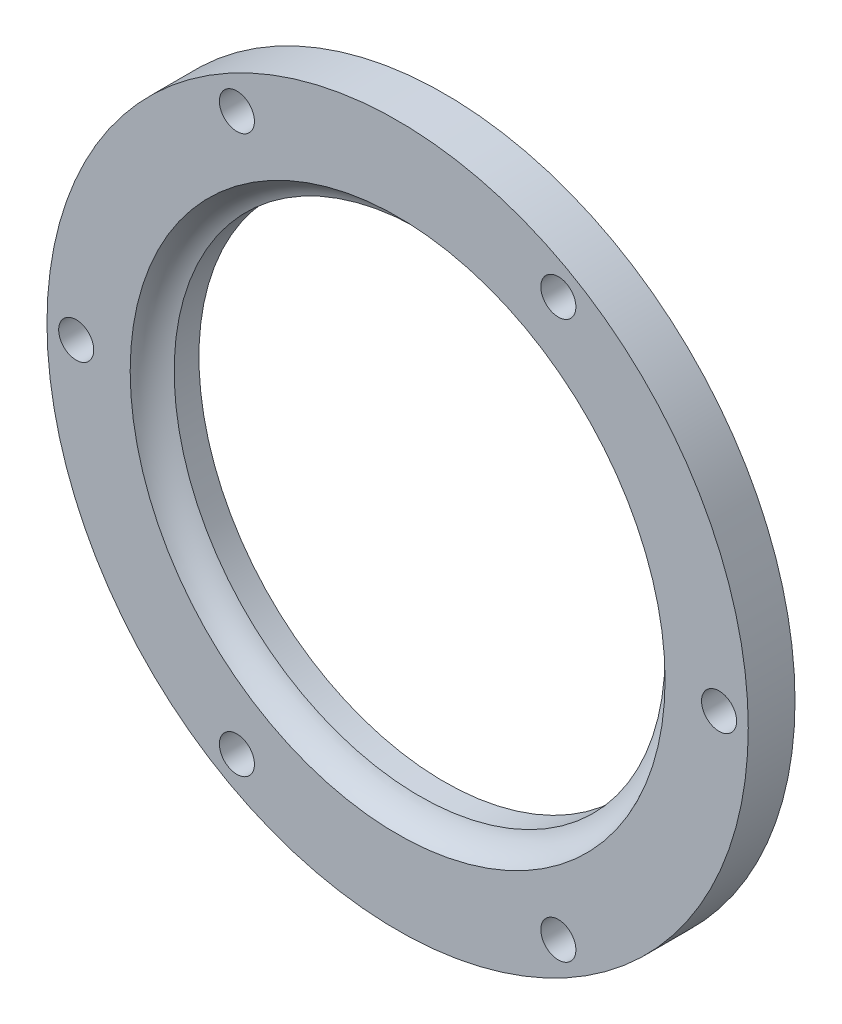
ISO-10303-21;
HEADER;
FILE_DESCRIPTION(('STEP AP214'),'2;1');
FILE_NAME('part.step','',(''),(''),'','','');
FILE_SCHEMA(('AUTOMOTIVE_DESIGN { 1 0 10303 214 1 1 1 1 }'));
ENDSEC;
DATA;
#1=APPLICATION_CONTEXT('core data for automotive mechanical design processes');
#2=APPLICATION_PROTOCOL_DEFINITION('international standard','automotive_design',2000,#1);
#3=PRODUCT_CONTEXT('',#1,'mechanical');
#4=PRODUCT('Part','Part','',(#3));
#5=PRODUCT_RELATED_PRODUCT_CATEGORY('part','',(#4));
#6=PRODUCT_DEFINITION_FORMATION('','',#4);
#7=PRODUCT_DEFINITION_CONTEXT('part definition',#1,'design');
#8=PRODUCT_DEFINITION('design','',#6,#7);
#9=PRODUCT_DEFINITION_SHAPE('','',#8);
#10=(LENGTH_UNIT() NAMED_UNIT(*) SI_UNIT(.MILLI.,.METRE.));
#11=(NAMED_UNIT(*) PLANE_ANGLE_UNIT() SI_UNIT($,.RADIAN.));
#12=(NAMED_UNIT(*) SI_UNIT($,.STERADIAN.) SOLID_ANGLE_UNIT());
#13=UNCERTAINTY_MEASURE_WITH_UNIT(LENGTH_MEASURE(1.E-05),#10,'distance_accuracy_value','');
#14=(GEOMETRIC_REPRESENTATION_CONTEXT(3) GLOBAL_UNCERTAINTY_ASSIGNED_CONTEXT((#13)) GLOBAL_UNIT_ASSIGNED_CONTEXT((#10,
#11,#12)) REPRESENTATION_CONTEXT('',''));
#15=CARTESIAN_POINT('',(0.,0.,0.));
#16=DIRECTION('',(0.,0.,1.));
#17=DIRECTION('',(1.,0.,0.));
#18=AXIS2_PLACEMENT_3D('',#15,#16,#17);
#19=CARTESIAN_POINT('',(0.,0.,4.));
#20=DIRECTION('',(0.,0.,-1.));
#21=DIRECTION('',(-1.,0.,0.));
#22=AXIS2_PLACEMENT_3D('',#19,#20,#21);
#23=CYLINDRICAL_SURFACE('',#22,21.);
#24=CARTESIAN_POINT('',(0.,0.,0.));
#25=DIRECTION('',(0.,0.,1.));
#26=DIRECTION('',(1.,0.,0.));
#27=AXIS2_PLACEMENT_3D('',#24,#25,#26);
#28=CIRCLE('',#27,21.);
#29=CARTESIAN_POINT('',(21.,0.,0.));
#30=VERTEX_POINT('',#29);
#31=EDGE_CURVE('E44',#30,#30,#28,.T.);
#32=ORIENTED_EDGE('',*,*,#31,.F.);
#33=EDGE_LOOP('',(#32));
#34=FACE_BOUND('',#33,.T.);
#35=CARTESIAN_POINT('',(0.,0.,2.11859409315522));
#36=DIRECTION('',(0.,0.,1.));
#37=DIRECTION('',(1.,0.,0.));
#38=AXIS2_PLACEMENT_3D('',#35,#36,#37);
#39=CIRCLE('',#38,21.);
#40=CARTESIAN_POINT('',(21.,0.,2.11859409315522));
#41=VERTEX_POINT('',#40);
#42=EDGE_CURVE('E35',#41,#41,#39,.T.);
#43=ORIENTED_EDGE('',*,*,#42,.T.);
#44=EDGE_LOOP('',(#43));
#45=FACE_BOUND('',#44,.T.);
#46=ADVANCED_FACE('F31',(#34,#45),#23,.F.);
#47=CARTESIAN_POINT('',(0.,0.,4.));
#48=DIRECTION('',(0.,0.,1.));
#49=DIRECTION('',(1.,0.,0.));
#50=AXIS2_PLACEMENT_3D('',#47,#48,#49);
#51=PLANE('',#50);
#52=CARTESIAN_POINT('',(-13.7500000000003,-23.8156986040719,4.));
#53=DIRECTION('',(0.,0.,1.));
#54=DIRECTION('',(1.,0.,0.));
#55=AXIS2_PLACEMENT_3D('',#52,#53,#54);
#56=CIRCLE('',#55,1.5);
#57=CARTESIAN_POINT('',(-12.2500000000003,-23.8156986040719,4.));
#58=VERTEX_POINT('',#57);
#59=EDGE_CURVE('E57',#58,#58,#56,.F.);
#60=ORIENTED_EDGE('',*,*,#59,.T.);
#61=EDGE_LOOP('',(#60));
#62=FACE_BOUND('',#61,.T.);
#63=CARTESIAN_POINT('',(13.7499999999998,-23.8156986040722,4.));
#64=DIRECTION('',(0.,0.,1.));
#65=DIRECTION('',(1.,0.,0.));
#66=AXIS2_PLACEMENT_3D('',#63,#64,#65);
#67=CIRCLE('',#66,1.5);
#68=CARTESIAN_POINT('',(15.2499999999998,-23.8156986040722,4.));
#69=VERTEX_POINT('',#68);
#70=EDGE_CURVE('E60',#69,#69,#67,.F.);
#71=ORIENTED_EDGE('',*,*,#70,.T.);
#72=EDGE_LOOP('',(#71));
#73=FACE_BOUND('',#72,.T.);
#74=CARTESIAN_POINT('',(27.5,0.,4.));
#75=DIRECTION('',(0.,0.,1.));
#76=DIRECTION('',(1.,0.,0.));
#77=AXIS2_PLACEMENT_3D('',#74,#75,#76);
#78=CIRCLE('',#77,1.5);
#79=CARTESIAN_POINT('',(29.,0.,4.));
#80=VERTEX_POINT('',#79);
#81=EDGE_CURVE('E63',#80,#80,#78,.F.);
#82=ORIENTED_EDGE('',*,*,#81,.T.);
#83=EDGE_LOOP('',(#82));
#84=FACE_BOUND('',#83,.T.);
#85=CARTESIAN_POINT('',(13.7500000000001,23.815698604072,4.));
#86=DIRECTION('',(0.,0.,1.));
#87=DIRECTION('',(1.,0.,0.));
#88=AXIS2_PLACEMENT_3D('',#85,#86,#87);
#89=CIRCLE('',#88,1.5);
#90=CARTESIAN_POINT('',(15.2500000000001,23.815698604072,4.));
#91=VERTEX_POINT('',#90);
#92=EDGE_CURVE('E66',#91,#91,#89,.F.);
#93=ORIENTED_EDGE('',*,*,#92,.T.);
#94=EDGE_LOOP('',(#93));
#95=FACE_BOUND('',#94,.T.);
#96=CARTESIAN_POINT('',(-13.7499999999999,23.8156986040721,4.));
#97=DIRECTION('',(0.,0.,1.));
#98=DIRECTION('',(1.,0.,0.));
#99=AXIS2_PLACEMENT_3D('',#96,#97,#98);
#100=CIRCLE('',#99,1.5);
#101=CARTESIAN_POINT('',(-12.2499999999999,23.8156986040721,4.));
#102=VERTEX_POINT('',#101);
#103=EDGE_CURVE('E69',#102,#102,#100,.F.);
#104=ORIENTED_EDGE('',*,*,#103,.T.);
#105=EDGE_LOOP('',(#104));
#106=FACE_BOUND('',#105,.T.);
#107=CARTESIAN_POINT('',(-27.5,0.,4.));
#108=DIRECTION('',(0.,0.,1.));
#109=DIRECTION('',(1.,0.,0.));
#110=AXIS2_PLACEMENT_3D('',#107,#108,#109);
#111=CIRCLE('',#110,1.5);
#112=CARTESIAN_POINT('',(-26.,0.,4.));
#113=VERTEX_POINT('',#112);
#114=EDGE_CURVE('E51',#113,#113,#111,.F.);
#115=ORIENTED_EDGE('',*,*,#114,.T.);
#116=EDGE_LOOP('',(#115));
#117=FACE_BOUND('',#116,.T.);
#118=CARTESIAN_POINT('',(0.,0.,4.));
#119=DIRECTION('',(0.,0.,1.));
#120=DIRECTION('',(1.,0.,0.));
#121=AXIS2_PLACEMENT_3D('',#118,#119,#120);
#122=CIRCLE('',#121,22.8814059068448);
#123=CARTESIAN_POINT('',(22.8814059068448,0.,4.));
#124=VERTEX_POINT('',#123);
#125=EDGE_CURVE('E48',#124,#124,#122,.F.);
#126=ORIENTED_EDGE('',*,*,#125,.T.);
#127=EDGE_LOOP('',(#126));
#128=FACE_BOUND('',#127,.T.);
#129=CARTESIAN_POINT('',(0.,0.,4.));
#130=DIRECTION('',(0.,0.,1.));
#131=DIRECTION('',(1.,0.,0.));
#132=AXIS2_PLACEMENT_3D('',#129,#130,#131);
#133=CIRCLE('',#132,30.);
#134=CARTESIAN_POINT('',(30.,0.,4.));
#135=VERTEX_POINT('',#134);
#136=EDGE_CURVE('E10',#135,#135,#133,.T.);
#137=ORIENTED_EDGE('',*,*,#136,.T.);
#138=EDGE_LOOP('',(#137));
#139=FACE_BOUND('',#138,.T.);
#140=ADVANCED_FACE('F109',(#62,#73,#84,#95,#106,#117,#128,#139),#51,.T.);
#141=CARTESIAN_POINT('',(0.,0.,0.));
#142=DIRECTION('',(0.,0.,1.));
#143=DIRECTION('',(1.,0.,0.));
#144=AXIS2_PLACEMENT_3D('',#141,#142,#143);
#145=PLANE('',#144);
#146=CARTESIAN_POINT('',(-13.7500000000003,-23.8156986040719,0.));
#147=DIRECTION('',(0.,0.,1.));
#148=DIRECTION('',(0.50000000000001,0.866025403784433,0.));
#149=AXIS2_PLACEMENT_3D('',#146,#147,#148);
#150=CIRCLE('',#149,1.5);
#151=CARTESIAN_POINT('',(-13.0000000000003,-22.5166604983953,0.));
#152=VERTEX_POINT('',#151);
#153=EDGE_CURVE('E76',#152,#152,#150,.T.);
#154=ORIENTED_EDGE('',*,*,#153,.T.);
#155=EDGE_LOOP('',(#154));
#156=FACE_BOUND('',#155,.T.);
#157=CARTESIAN_POINT('',(13.7499999999998,-23.8156986040722,0.));
#158=DIRECTION('',(0.,0.,1.));
#159=DIRECTION('',(-0.499999999999992,0.866025403784443,0.));
#160=AXIS2_PLACEMENT_3D('',#157,#158,#159);
#161=CIRCLE('',#160,1.5);
#162=CARTESIAN_POINT('',(12.9999999999998,-22.5166604983955,0.));
#163=VERTEX_POINT('',#162);
#164=EDGE_CURVE('E79',#163,#163,#161,.T.);
#165=ORIENTED_EDGE('',*,*,#164,.T.);
#166=EDGE_LOOP('',(#165));
#167=FACE_BOUND('',#166,.T.);
#168=CARTESIAN_POINT('',(27.5,0.,0.));
#169=DIRECTION('',(0.,0.,1.));
#170=DIRECTION('',(-1.,0.,0.));
#171=AXIS2_PLACEMENT_3D('',#168,#169,#170);
#172=CIRCLE('',#171,1.5);
#173=CARTESIAN_POINT('',(26.,0.,0.));
#174=VERTEX_POINT('',#173);
#175=EDGE_CURVE('E82',#174,#174,#172,.T.);
#176=ORIENTED_EDGE('',*,*,#175,.T.);
#177=EDGE_LOOP('',(#176));
#178=FACE_BOUND('',#177,.T.);
#179=CARTESIAN_POINT('',(13.7500000000001,23.815698604072,0.));
#180=DIRECTION('',(0.,0.,1.));
#181=DIRECTION('',(-0.500000000000004,-0.866025403784436,0.));
#182=AXIS2_PLACEMENT_3D('',#179,#180,#181);
#183=CIRCLE('',#182,1.5);
#184=CARTESIAN_POINT('',(13.0000000000001,22.5166604983954,0.));
#185=VERTEX_POINT('',#184);
#186=EDGE_CURVE('E75',#185,#185,#183,.T.);
#187=ORIENTED_EDGE('',*,*,#186,.T.);
#188=EDGE_LOOP('',(#187));
#189=FACE_BOUND('',#188,.T.);
#190=CARTESIAN_POINT('',(-13.7499999999999,23.8156986040721,0.));
#191=DIRECTION('',(0.,0.,1.));
#192=DIRECTION('',(0.499999999999998,-0.86602540378444,0.));
#193=AXIS2_PLACEMENT_3D('',#190,#191,#192);
#194=CIRCLE('',#193,1.5);
#195=CARTESIAN_POINT('',(-12.9999999999999,22.5166604983954,0.));
#196=VERTEX_POINT('',#195);
#197=EDGE_CURVE('E72',#196,#196,#194,.T.);
#198=ORIENTED_EDGE('',*,*,#197,.T.);
#199=EDGE_LOOP('',(#198));
#200=FACE_BOUND('',#199,.T.);
#201=CARTESIAN_POINT('',(-27.5,0.,0.));
#202=DIRECTION('',(0.,0.,1.));
#203=DIRECTION('',(1.,0.,0.));
#204=AXIS2_PLACEMENT_3D('',#201,#202,#203);
#205=CIRCLE('',#204,1.5);
#206=CARTESIAN_POINT('',(-26.,0.,0.));
#207=VERTEX_POINT('',#206);
#208=EDGE_CURVE('E54',#207,#207,#205,.T.);
#209=ORIENTED_EDGE('',*,*,#208,.T.);
#210=EDGE_LOOP('',(#209));
#211=FACE_BOUND('',#210,.T.);
#212=CARTESIAN_POINT('',(0.,0.,0.));
#213=DIRECTION('',(0.,0.,1.));
#214=DIRECTION('',(1.,0.,0.));
#215=AXIS2_PLACEMENT_3D('',#212,#213,#214);
#216=CIRCLE('',#215,30.);
#217=CARTESIAN_POINT('',(30.,0.,0.));
#218=VERTEX_POINT('',#217);
#219=EDGE_CURVE('E39',#218,#218,#216,.T.);
#220=ORIENTED_EDGE('',*,*,#219,.F.);
#221=EDGE_LOOP('',(#220));
#222=FACE_BOUND('',#221,.T.);
#223=ORIENTED_EDGE('',*,*,#31,.T.);
#224=EDGE_LOOP('',(#223));
#225=FACE_BOUND('',#224,.T.);
#226=ADVANCED_FACE('F88',(#156,#167,#178,#189,#200,#211,#222,#225),#145,.F.);
#227=CARTESIAN_POINT('',(0.,0.,4.));
#228=DIRECTION('',(0.,0.,-1.));
#229=DIRECTION('',(-1.,0.,0.));
#230=AXIS2_PLACEMENT_3D('',#227,#228,#229);
#231=CYLINDRICAL_SURFACE('',#230,30.);
#232=ORIENTED_EDGE('',*,*,#136,.F.);
#233=EDGE_LOOP('',(#232));
#234=FACE_BOUND('',#233,.T.);
#235=ORIENTED_EDGE('',*,*,#219,.T.);
#236=EDGE_LOOP('',(#235));
#237=FACE_BOUND('',#236,.T.);
#238=ADVANCED_FACE('F33',(#234,#237),#231,.T.);
#239=CARTESIAN_POINT('',(0.,0.,5.));
#240=DIRECTION('',(0.,0.,1.));
#241=DIRECTION('',(1.,0.,0.));
#242=AXIS2_PLACEMENT_3D('',#239,#240,#241);
#243=TOROIDAL_SURFACE('',#242,20.,3.05);
#244=ORIENTED_EDGE('',*,*,#125,.F.);
#245=EDGE_LOOP('',(#244));
#246=FACE_BOUND('',#245,.T.);
#247=ORIENTED_EDGE('',*,*,#42,.F.);
#248=EDGE_LOOP('',(#247));
#249=FACE_BOUND('',#248,.T.);
#250=ADVANCED_FACE('F120',(#246,#249),#243,.F.);
#251=CARTESIAN_POINT('',(-27.5,0.,10.));
#252=DIRECTION('',(0.,0.,-1.));
#253=DIRECTION('',(-1.,0.,0.));
#254=AXIS2_PLACEMENT_3D('',#251,#252,#253);
#255=CYLINDRICAL_SURFACE('',#254,1.5);
#256=ORIENTED_EDGE('',*,*,#114,.F.);
#257=EDGE_LOOP('',(#256));
#258=FACE_BOUND('',#257,.T.);
#259=ORIENTED_EDGE('',*,*,#208,.F.);
#260=EDGE_LOOP('',(#259));
#261=FACE_BOUND('',#260,.T.);
#262=ADVANCED_FACE('F104',(#258,#261),#255,.F.);
#263=CARTESIAN_POINT('',(-13.7499999999999,23.8156986040721,10.));
#264=DIRECTION('',(0.,0.,-1.));
#265=DIRECTION('',(-1.,0.,0.));
#266=AXIS2_PLACEMENT_3D('',#263,#264,#265);
#267=CYLINDRICAL_SURFACE('',#266,1.5);
#268=ORIENTED_EDGE('',*,*,#103,.F.);
#269=EDGE_LOOP('',(#268));
#270=FACE_BOUND('',#269,.T.);
#271=ORIENTED_EDGE('',*,*,#197,.F.);
#272=EDGE_LOOP('',(#271));
#273=FACE_BOUND('',#272,.T.);
#274=ADVANCED_FACE('F94',(#270,#273),#267,.F.);
#275=CARTESIAN_POINT('',(13.7500000000001,23.815698604072,10.));
#276=DIRECTION('',(0.,0.,-1.));
#277=DIRECTION('',(-1.,0.,0.));
#278=AXIS2_PLACEMENT_3D('',#275,#276,#277);
#279=CYLINDRICAL_SURFACE('',#278,1.5);
#280=ORIENTED_EDGE('',*,*,#92,.F.);
#281=EDGE_LOOP('',(#280));
#282=FACE_BOUND('',#281,.T.);
#283=ORIENTED_EDGE('',*,*,#186,.F.);
#284=EDGE_LOOP('',(#283));
#285=FACE_BOUND('',#284,.T.);
#286=ADVANCED_FACE('F91',(#282,#285),#279,.F.);
#287=CARTESIAN_POINT('',(27.5,0.,10.));
#288=DIRECTION('',(0.,0.,-1.));
#289=DIRECTION('',(-1.,0.,0.));
#290=AXIS2_PLACEMENT_3D('',#287,#288,#289);
#291=CYLINDRICAL_SURFACE('',#290,1.5);
#292=ORIENTED_EDGE('',*,*,#81,.F.);
#293=EDGE_LOOP('',(#292));
#294=FACE_BOUND('',#293,.T.);
#295=ORIENTED_EDGE('',*,*,#175,.F.);
#296=EDGE_LOOP('',(#295));
#297=FACE_BOUND('',#296,.T.);
#298=ADVANCED_FACE('F93',(#294,#297),#291,.F.);
#299=CARTESIAN_POINT('',(13.7499999999998,-23.8156986040722,10.));
#300=DIRECTION('',(0.,0.,-1.));
#301=DIRECTION('',(-1.,0.,0.));
#302=AXIS2_PLACEMENT_3D('',#299,#300,#301);
#303=CYLINDRICAL_SURFACE('',#302,1.5);
#304=ORIENTED_EDGE('',*,*,#70,.F.);
#305=EDGE_LOOP('',(#304));
#306=FACE_BOUND('',#305,.T.);
#307=ORIENTED_EDGE('',*,*,#164,.F.);
#308=EDGE_LOOP('',(#307));
#309=FACE_BOUND('',#308,.T.);
#310=ADVANCED_FACE('F101',(#306,#309),#303,.F.);
#311=CARTESIAN_POINT('',(-13.7500000000003,-23.8156986040719,10.));
#312=DIRECTION('',(0.,0.,-1.));
#313=DIRECTION('',(-1.,0.,0.));
#314=AXIS2_PLACEMENT_3D('',#311,#312,#313);
#315=CYLINDRICAL_SURFACE('',#314,1.5);
#316=ORIENTED_EDGE('',*,*,#59,.F.);
#317=EDGE_LOOP('',(#316));
#318=FACE_BOUND('',#317,.T.);
#319=ORIENTED_EDGE('',*,*,#153,.F.);
#320=EDGE_LOOP('',(#319));
#321=FACE_BOUND('',#320,.T.);
#322=ADVANCED_FACE('F136',(#318,#321),#315,.F.);
#323=CLOSED_SHELL('',(#46,#140,#226,#238,#250,#262,#274,#286,#298,#310,#322));
#324=MANIFOLD_SOLID_BREP('B2',#323);
#325=ADVANCED_BREP_SHAPE_REPRESENTATION('',(#18,#324),#14);
#326=SHAPE_DEFINITION_REPRESENTATION(#9,#325);
ENDSEC;
END-ISO-10303-21;
